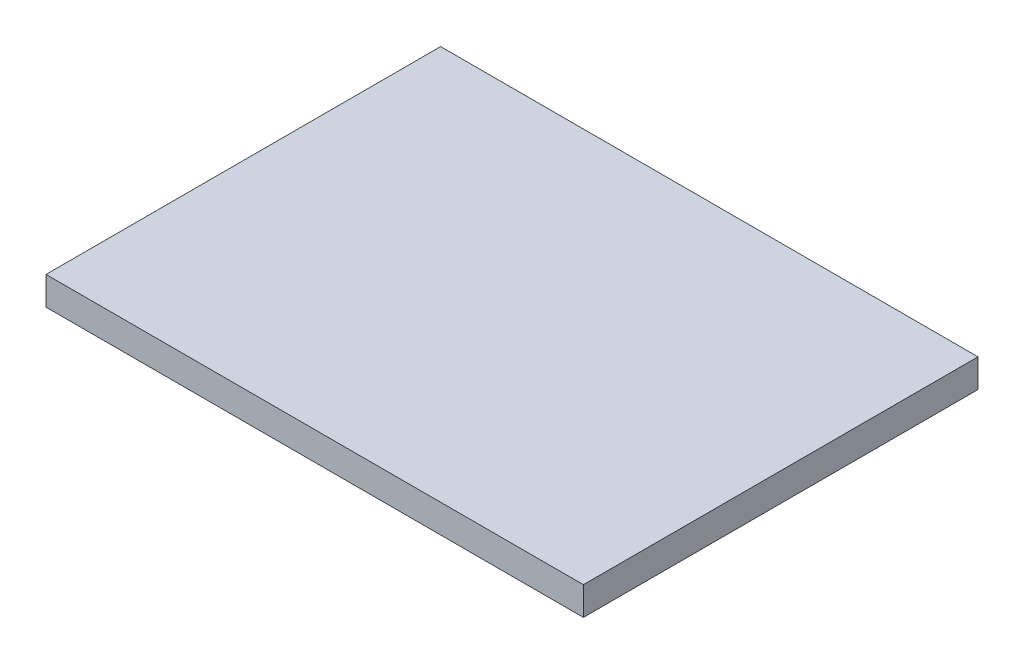
ISO-10303-21;
HEADER;
FILE_DESCRIPTION(('STEP AP214'),'2;1');
FILE_NAME('part.step','',(''),(''),'','','');
FILE_SCHEMA(('AUTOMOTIVE_DESIGN { 1 0 10303 214 1 1 1 1 }'));
ENDSEC;
DATA;
#1=APPLICATION_CONTEXT('core data for automotive mechanical design processes');
#2=APPLICATION_PROTOCOL_DEFINITION('international standard','automotive_design',2000,#1);
#3=PRODUCT_CONTEXT('',#1,'mechanical');
#4=PRODUCT('Part','Part','',(#3));
#5=PRODUCT_RELATED_PRODUCT_CATEGORY('part','',(#4));
#6=PRODUCT_DEFINITION_FORMATION('','',#4);
#7=PRODUCT_DEFINITION_CONTEXT('part definition',#1,'design');
#8=PRODUCT_DEFINITION('design','',#6,#7);
#9=PRODUCT_DEFINITION_SHAPE('','',#8);
#10=(LENGTH_UNIT() NAMED_UNIT(*) SI_UNIT(.MILLI.,.METRE.));
#11=(NAMED_UNIT(*) PLANE_ANGLE_UNIT() SI_UNIT($,.RADIAN.));
#12=(NAMED_UNIT(*) SI_UNIT($,.STERADIAN.) SOLID_ANGLE_UNIT());
#13=UNCERTAINTY_MEASURE_WITH_UNIT(LENGTH_MEASURE(1.E-05),#10,'distance_accuracy_value','');
#14=(GEOMETRIC_REPRESENTATION_CONTEXT(3) GLOBAL_UNCERTAINTY_ASSIGNED_CONTEXT((#13)) GLOBAL_UNIT_ASSIGNED_CONTEXT((#10,
#11,#12)) REPRESENTATION_CONTEXT('',''));
#15=CARTESIAN_POINT('',(0.,0.,0.));
#16=DIRECTION('',(0.,0.,1.));
#17=DIRECTION('',(1.,0.,0.));
#18=AXIS2_PLACEMENT_3D('',#15,#16,#17);
#19=CARTESIAN_POINT('',(-33.1395180722892,2.95,-18.1838303519558));
#20=DIRECTION('',(1.,0.,0.));
#21=DIRECTION('',(0.,0.,-1.));
#22=AXIS2_PLACEMENT_3D('',#19,#20,#21);
#23=PLANE('',#22);
#24=DIRECTION('',(0.,0.,1.));
#25=VECTOR('',#24,1.);
#26=CARTESIAN_POINT('',(-33.1395180722892,0.,-18.1838303519558));
#27=LINE('',#26,#25);
#28=CARTESIAN_POINT('',(-33.1395180722892,0.,-18.1838303519558));
#29=VERTEX_POINT('',#28);
#30=CARTESIAN_POINT('',(-33.1395180722892,0.,22.8661696480442));
#31=VERTEX_POINT('',#30);
#32=EDGE_CURVE('E96',#29,#31,#27,.T.);
#33=ORIENTED_EDGE('',*,*,#32,.T.);
#34=DIRECTION('',(0.,-1.,0.));
#35=VECTOR('',#34,1.);
#36=CARTESIAN_POINT('',(-33.1395180722892,2.95,22.8661696480442));
#37=LINE('',#36,#35);
#38=CARTESIAN_POINT('',(-33.1395180722892,2.95,22.8661696480442));
#39=VERTEX_POINT('',#38);
#40=EDGE_CURVE('E11',#39,#31,#37,.T.);
#41=ORIENTED_EDGE('',*,*,#40,.F.);
#42=DIRECTION('',(0.,0.,1.));
#43=VECTOR('',#42,1.);
#44=CARTESIAN_POINT('',(-33.1395180722892,2.95,-18.1838303519558));
#45=LINE('',#44,#43);
#46=CARTESIAN_POINT('',(-33.1395180722892,2.95,-18.1838303519558));
#47=VERTEX_POINT('',#46);
#48=EDGE_CURVE('E84',#47,#39,#45,.T.);
#49=ORIENTED_EDGE('',*,*,#48,.F.);
#50=DIRECTION('',(0.,-1.,0.));
#51=VECTOR('',#50,1.);
#52=CARTESIAN_POINT('',(-33.1395180722892,2.95,-18.1838303519558));
#53=LINE('',#52,#51);
#54=EDGE_CURVE('E92',#47,#29,#53,.T.);
#55=ORIENTED_EDGE('',*,*,#54,.T.);
#56=EDGE_LOOP('',(#33,#41,#49,#55));
#57=FACE_BOUND('',#56,.T.);
#58=ADVANCED_FACE('F33',(#57),#23,.F.);
#59=CARTESIAN_POINT('',(-33.1395180722892,2.95,22.8661696480442));
#60=DIRECTION('',(0.,0.,-1.));
#61=DIRECTION('',(-1.,0.,0.));
#62=AXIS2_PLACEMENT_3D('',#59,#60,#61);
#63=PLANE('',#62);
#64=DIRECTION('',(1.,0.,0.));
#65=VECTOR('',#64,1.);
#66=CARTESIAN_POINT('',(-33.1395180722892,0.,22.8661696480442));
#67=LINE('',#66,#65);
#68=CARTESIAN_POINT('',(22.7604819277108,0.,22.8661696480442));
#69=VERTEX_POINT('',#68);
#70=EDGE_CURVE('E88',#31,#69,#67,.T.);
#71=ORIENTED_EDGE('',*,*,#70,.T.);
#72=DIRECTION('',(0.,-1.,0.));
#73=VECTOR('',#72,1.);
#74=CARTESIAN_POINT('',(22.7604819277108,2.95,22.8661696480442));
#75=LINE('',#74,#73);
#76=CARTESIAN_POINT('',(22.7604819277108,2.95,22.8661696480442));
#77=VERTEX_POINT('',#76);
#78=EDGE_CURVE('E41',#77,#69,#75,.T.);
#79=ORIENTED_EDGE('',*,*,#78,.F.);
#80=DIRECTION('',(1.,0.,0.));
#81=VECTOR('',#80,1.);
#82=CARTESIAN_POINT('',(-33.1395180722892,2.95,22.8661696480442));
#83=LINE('',#82,#81);
#84=EDGE_CURVE('E79',#39,#77,#83,.T.);
#85=ORIENTED_EDGE('',*,*,#84,.F.);
#86=ORIENTED_EDGE('',*,*,#40,.T.);
#87=EDGE_LOOP('',(#71,#79,#85,#86));
#88=FACE_BOUND('',#87,.T.);
#89=ADVANCED_FACE('F87',(#88),#63,.F.);
#90=CARTESIAN_POINT('',(22.7604819277108,2.95,-18.1838303519558));
#91=DIRECTION('',(-1.,0.,0.));
#92=DIRECTION('',(0.,0.,1.));
#93=AXIS2_PLACEMENT_3D('',#90,#91,#92);
#94=PLANE('',#93);
#95=DIRECTION('',(0.,0.,-1.));
#96=VECTOR('',#95,1.);
#97=CARTESIAN_POINT('',(22.7604819277108,0.,-18.1838303519558));
#98=LINE('',#97,#96);
#99=CARTESIAN_POINT('',(22.7604819277108,0.,-18.1838303519558));
#100=VERTEX_POINT('',#99);
#101=EDGE_CURVE('E66',#69,#100,#98,.T.);
#102=ORIENTED_EDGE('',*,*,#101,.T.);
#103=DIRECTION('',(0.,-1.,0.));
#104=VECTOR('',#103,1.);
#105=CARTESIAN_POINT('',(22.7604819277108,2.95,-18.1838303519558));
#106=LINE('',#105,#104);
#107=CARTESIAN_POINT('',(22.7604819277108,2.95,-18.1838303519558));
#108=VERTEX_POINT('',#107);
#109=EDGE_CURVE('E89',#108,#100,#106,.T.);
#110=ORIENTED_EDGE('',*,*,#109,.F.);
#111=DIRECTION('',(0.,0.,-1.));
#112=VECTOR('',#111,1.);
#113=CARTESIAN_POINT('',(22.7604819277108,2.95,-18.1838303519558));
#114=LINE('',#113,#112);
#115=EDGE_CURVE('E82',#77,#108,#114,.T.);
#116=ORIENTED_EDGE('',*,*,#115,.F.);
#117=ORIENTED_EDGE('',*,*,#78,.T.);
#118=EDGE_LOOP('',(#102,#110,#116,#117));
#119=FACE_BOUND('',#118,.T.);
#120=ADVANCED_FACE('F90',(#119),#94,.F.);
#121=CARTESIAN_POINT('',(-33.1395180722892,2.95,-18.1838303519558));
#122=DIRECTION('',(0.,0.,1.));
#123=DIRECTION('',(1.,0.,0.));
#124=AXIS2_PLACEMENT_3D('',#121,#122,#123);
#125=PLANE('',#124);
#126=DIRECTION('',(-1.,0.,0.));
#127=VECTOR('',#126,1.);
#128=CARTESIAN_POINT('',(-33.1395180722892,0.,-18.1838303519558));
#129=LINE('',#128,#127);
#130=EDGE_CURVE('E72',#100,#29,#129,.T.);
#131=ORIENTED_EDGE('',*,*,#130,.T.);
#132=ORIENTED_EDGE('',*,*,#54,.F.);
#133=DIRECTION('',(-1.,0.,0.));
#134=VECTOR('',#133,1.);
#135=CARTESIAN_POINT('',(-33.1395180722892,2.95,-18.1838303519558));
#136=LINE('',#135,#134);
#137=EDGE_CURVE('E49',#108,#47,#136,.T.);
#138=ORIENTED_EDGE('',*,*,#137,.F.);
#139=ORIENTED_EDGE('',*,*,#109,.T.);
#140=EDGE_LOOP('',(#131,#132,#138,#139));
#141=FACE_BOUND('',#140,.T.);
#142=ADVANCED_FACE('F103',(#141),#125,.F.);
#143=CARTESIAN_POINT('',(0.,2.95,0.));
#144=DIRECTION('',(0.,1.,0.));
#145=DIRECTION('',(0.,0.,1.));
#146=AXIS2_PLACEMENT_3D('',#143,#144,#145);
#147=PLANE('',#146);
#148=ORIENTED_EDGE('',*,*,#48,.T.);
#149=ORIENTED_EDGE('',*,*,#84,.T.);
#150=ORIENTED_EDGE('',*,*,#115,.T.);
#151=ORIENTED_EDGE('',*,*,#137,.T.);
#152=EDGE_LOOP('',(#148,#149,#150,#151));
#153=FACE_BOUND('',#152,.T.);
#154=ADVANCED_FACE('F80',(#153),#147,.T.);
#155=CARTESIAN_POINT('',(0.,0.,0.));
#156=DIRECTION('',(0.,1.,0.));
#157=DIRECTION('',(0.,0.,1.));
#158=AXIS2_PLACEMENT_3D('',#155,#156,#157);
#159=PLANE('',#158);
#160=ORIENTED_EDGE('',*,*,#32,.F.);
#161=ORIENTED_EDGE('',*,*,#130,.F.);
#162=ORIENTED_EDGE('',*,*,#101,.F.);
#163=ORIENTED_EDGE('',*,*,#70,.F.);
#164=EDGE_LOOP('',(#160,#161,#162,#163));
#165=FACE_BOUND('',#164,.T.);
#166=ADVANCED_FACE('F106',(#165),#159,.F.);
#167=CLOSED_SHELL('',(#58,#89,#120,#142,#154,#166));
#168=MANIFOLD_SOLID_BREP('B2',#167);
#169=ADVANCED_BREP_SHAPE_REPRESENTATION('',(#18,#168),#14);
#170=SHAPE_DEFINITION_REPRESENTATION(#9,#169);
ENDSEC;
END-ISO-10303-21;
